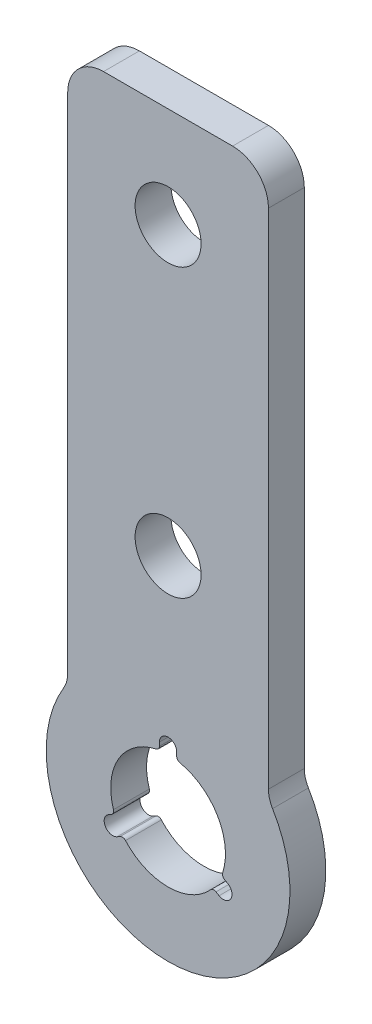
ISO-10303-21;
HEADER;
FILE_DESCRIPTION(('STEP AP214'),'2;1');
FILE_NAME('part.step','',(''),(''),'','','');
FILE_SCHEMA(('AUTOMOTIVE_DESIGN { 1 0 10303 214 1 1 1 1 }'));
ENDSEC;
DATA;
#1=APPLICATION_CONTEXT('core data for automotive mechanical design processes');
#2=APPLICATION_PROTOCOL_DEFINITION('international standard','automotive_design',2000,#1);
#3=PRODUCT_CONTEXT('',#1,'mechanical');
#4=PRODUCT('Part','Part','',(#3));
#5=PRODUCT_RELATED_PRODUCT_CATEGORY('part','',(#4));
#6=PRODUCT_DEFINITION_FORMATION('','',#4);
#7=PRODUCT_DEFINITION_CONTEXT('part definition',#1,'design');
#8=PRODUCT_DEFINITION('design','',#6,#7);
#9=PRODUCT_DEFINITION_SHAPE('','',#8);
#10=(LENGTH_UNIT() NAMED_UNIT(*) SI_UNIT(.MILLI.,.METRE.));
#11=(NAMED_UNIT(*) PLANE_ANGLE_UNIT() SI_UNIT($,.RADIAN.));
#12=(NAMED_UNIT(*) SI_UNIT($,.STERADIAN.) SOLID_ANGLE_UNIT());
#13=UNCERTAINTY_MEASURE_WITH_UNIT(LENGTH_MEASURE(1.E-05),#10,'distance_accuracy_value','');
#14=(GEOMETRIC_REPRESENTATION_CONTEXT(3) GLOBAL_UNCERTAINTY_ASSIGNED_CONTEXT((#13)) GLOBAL_UNIT_ASSIGNED_CONTEXT((#10,
#11,#12)) REPRESENTATION_CONTEXT('',''));
#15=CARTESIAN_POINT('',(0.,0.,0.));
#16=DIRECTION('',(0.,0.,1.));
#17=DIRECTION('',(1.,0.,0.));
#18=AXIS2_PLACEMENT_3D('',#15,#16,#17);
#19=CARTESIAN_POINT('',(0.183350414531519,-17.8927513227513,2.5));
#20=DIRECTION('',(0.,0.,1.));
#21=DIRECTION('',(1.,0.,0.));
#22=AXIS2_PLACEMENT_3D('',#19,#20,#21);
#23=PLANE('',#22);
#24=CARTESIAN_POINT('',(0.183350414531519,-1.89275132275134,2.5));
#25=DIRECTION('',(0.,0.,1.));
#26=DIRECTION('',(1.,0.,0.));
#27=AXIS2_PLACEMENT_3D('',#24,#25,#26);
#28=CIRCLE('',#27,2.3);
#29=CARTESIAN_POINT('',(2.48335041453152,-1.89275132275134,2.5));
#30=VERTEX_POINT('',#29);
#31=EDGE_CURVE('E267',#30,#30,#28,.T.);
#32=ORIENTED_EDGE('',*,*,#31,.F.);
#33=EDGE_LOOP('',(#32));
#34=FACE_BOUND('',#33,.T.);
#35=CARTESIAN_POINT('',(0.183350414531519,-17.8927513227513,2.5));
#36=DIRECTION('',(0.,0.,1.));
#37=DIRECTION('',(1.,0.,0.));
#38=AXIS2_PLACEMENT_3D('',#35,#36,#37);
#39=CIRCLE('',#38,8.49999999999999);
#40=CARTESIAN_POINT('',(-7.10236387118249,-13.5145819168303,2.5));
#41=VERTEX_POINT('',#40);
#42=CARTESIAN_POINT('',(7.46906470024554,-13.5145819168303,2.5));
#43=VERTEX_POINT('',#42);
#44=EDGE_CURVE('E347',#41,#43,#39,.T.);
#45=ORIENTED_EDGE('',*,*,#44,.T.);
#46=CARTESIAN_POINT('',(9.18335041453152,-12.4844244095553,2.5));
#47=DIRECTION('',(0.,0.,-1.));
#48=DIRECTION('',(1.,0.,0.));
#49=AXIS2_PLACEMENT_3D('',#46,#47,#48);
#50=CIRCLE('',#49,2.00000000000001);
#51=CARTESIAN_POINT('',(7.18335041453152,-12.4844244095553,2.5));
#52=VERTEX_POINT('',#51);
#53=EDGE_CURVE('E350',#43,#52,#50,.T.);
#54=ORIENTED_EDGE('',*,*,#53,.T.);
#55=DIRECTION('',(0.,1.,0.));
#56=VECTOR('',#55,1.);
#57=CARTESIAN_POINT('',(7.18335041453152,-12.4844244095553,2.5));
#58=LINE('',#57,#56);
#59=CARTESIAN_POINT('',(7.18335041453151,22.6072486772487,2.5));
#60=VERTEX_POINT('',#59);
#61=EDGE_CURVE('E353',#52,#60,#58,.T.);
#62=ORIENTED_EDGE('',*,*,#61,.T.);
#63=CARTESIAN_POINT('',(4.68335041453152,22.6072486772487,2.5));
#64=DIRECTION('',(0.,0.,1.));
#65=DIRECTION('',(1.,0.,0.));
#66=AXIS2_PLACEMENT_3D('',#63,#64,#65);
#67=CIRCLE('',#66,2.5);
#68=CARTESIAN_POINT('',(4.68335041453152,25.1072486772487,2.5));
#69=VERTEX_POINT('',#68);
#70=EDGE_CURVE('E355',#60,#69,#67,.T.);
#71=ORIENTED_EDGE('',*,*,#70,.T.);
#72=DIRECTION('',(-1.,0.,0.));
#73=VECTOR('',#72,1.);
#74=CARTESIAN_POINT('',(4.68335041453152,25.1072486772487,2.5));
#75=LINE('',#74,#73);
#76=CARTESIAN_POINT('',(-4.31664958546848,25.1072486772487,2.5));
#77=VERTEX_POINT('',#76);
#78=EDGE_CURVE('E357',#69,#77,#75,.T.);
#79=ORIENTED_EDGE('',*,*,#78,.T.);
#80=CARTESIAN_POINT('',(-4.31664958546848,22.6072486772487,2.5));
#81=DIRECTION('',(0.,0.,1.));
#82=DIRECTION('',(1.,0.,0.));
#83=AXIS2_PLACEMENT_3D('',#80,#81,#82);
#84=CIRCLE('',#83,2.5);
#85=CARTESIAN_POINT('',(-6.81664958546848,22.6072486772487,2.5));
#86=VERTEX_POINT('',#85);
#87=EDGE_CURVE('E359',#77,#86,#84,.T.);
#88=ORIENTED_EDGE('',*,*,#87,.T.);
#89=DIRECTION('',(0.,-1.,0.));
#90=VECTOR('',#89,1.);
#91=CARTESIAN_POINT('',(-6.81664958546848,22.6072486772487,2.5));
#92=LINE('',#91,#90);
#93=CARTESIAN_POINT('',(-6.81664958546847,-12.4844244095553,2.5));
#94=VERTEX_POINT('',#93);
#95=EDGE_CURVE('E361',#86,#94,#92,.T.);
#96=ORIENTED_EDGE('',*,*,#95,.T.);
#97=CARTESIAN_POINT('',(-8.81664958546848,-12.4844244095553,2.5));
#98=DIRECTION('',(0.,0.,-1.));
#99=DIRECTION('',(1.,0.,0.));
#100=AXIS2_PLACEMENT_3D('',#97,#98,#99);
#101=CIRCLE('',#100,2.00000000000002);
#102=EDGE_CURVE('E363',#94,#41,#101,.T.);
#103=ORIENTED_EDGE('',*,*,#102,.T.);
#104=EDGE_LOOP('',(#45,#54,#62,#71,#79,#88,#96,#103));
#105=FACE_BOUND('',#104,.T.);
#106=CARTESIAN_POINT('',(0.183350414531519,-17.8927513227513,2.5));
#107=DIRECTION('',(0.,0.,1.));
#108=DIRECTION('',(1.,0.,0.));
#109=AXIS2_PLACEMENT_3D('',#106,#107,#108);
#110=CIRCLE('',#109,4.00000000000035);
#111=CARTESIAN_POINT('',(3.98933022030555,-19.1234087560134,2.5));
#112=VERTEX_POINT('',#111);
#113=CARTESIAN_POINT('',(1.02055971685711,-13.9813474080294,2.5));
#114=VERTEX_POINT('',#113);
#115=EDGE_CURVE('E217',#112,#114,#110,.T.);
#116=ORIENTED_EDGE('',*,*,#115,.F.);
#117=CARTESIAN_POINT('',(4.2747787057381,-19.2157080635091,2.5));
#118=DIRECTION('',(0.,0.,-1.));
#119=DIRECTION('',(1.,0.,0.));
#120=AXIS2_PLACEMENT_3D('',#117,#118,#119);
#121=CIRCLE('',#120,0.299999999999881);
#122=CARTESIAN_POINT('',(4.124778705738,-19.4755156846442,2.5));
#123=VERTEX_POINT('',#122);
#124=EDGE_CURVE('E209',#123,#112,#121,.T.);
#125=ORIENTED_EDGE('',*,*,#124,.F.);
#126=DIRECTION('',(-0.866025403784713,0.499999999999524,0.));
#127=VECTOR('',#126,1.);
#128=CARTESIAN_POINT('',(4.3412718743323,-19.6005080738097,2.5));
#129=LINE('',#128,#127);
#130=CARTESIAN_POINT('',(4.34127187433219,-19.6005080738096,2.5));
#131=VERTEX_POINT('',#130);
#132=EDGE_CURVE('E264',#131,#123,#129,.T.);
#133=ORIENTED_EDGE('',*,*,#132,.F.);
#134=CARTESIAN_POINT('',(4.04127187433252,-20.1201233160803,2.5));
#135=DIRECTION('',(0.,0.,1.));
#136=DIRECTION('',(1.,0.,0.));
#137=AXIS2_PLACEMENT_3D('',#134,#135,#136);
#138=CIRCLE('',#137,0.599999999999643);
#139=CARTESIAN_POINT('',(3.74127187433252,-20.6397385583503,2.5));
#140=VERTEX_POINT('',#139);
#141=EDGE_CURVE('E262',#140,#131,#138,.T.);
#142=ORIENTED_EDGE('',*,*,#141,.F.);
#143=DIRECTION('',(0.866025403784714,-0.499999999999523,0.));
#144=VECTOR('',#143,1.);
#145=CARTESIAN_POINT('',(3.52477870573853,-20.514746169185,2.5));
#146=LINE('',#145,#144);
#147=CARTESIAN_POINT('',(3.52477870573853,-20.514746169185,2.5));
#148=VERTEX_POINT('',#147);
#149=EDGE_CURVE('E260',#148,#140,#146,.T.);
#150=ORIENTED_EDGE('',*,*,#149,.F.);
#151=CARTESIAN_POINT('',(3.37477870573817,-20.7745537903207,2.5));
#152=DIRECTION('',(0.,0.,-1.));
#153=DIRECTION('',(1.,0.,0.));
#154=AXIS2_PLACEMENT_3D('',#151,#152,#153);
#155=CIRCLE('',#154,0.300000000000423);
#156=CARTESIAN_POINT('',(3.15212091797926,-20.5734978042107,2.5));
#157=VERTEX_POINT('',#156);
#158=EDGE_CURVE('E258',#157,#148,#155,.T.);
#159=ORIENTED_EDGE('',*,*,#158,.F.);
#160=CARTESIAN_POINT('',(0.18335041453117,-17.8927513227517,2.5));
#161=DIRECTION('',(0.,0.,1.));
#162=DIRECTION('',(1.,0.,0.));
#163=AXIS2_PLACEMENT_3D('',#160,#161,#162);
#164=CIRCLE('',#163,3.99999999999983);
#165=CARTESIAN_POINT('',(-2.78542008891692,-20.5734978042107,2.5));
#166=VERTEX_POINT('',#165);
#167=EDGE_CURVE('E256',#166,#157,#164,.T.);
#168=ORIENTED_EDGE('',*,*,#167,.F.);
#169=CARTESIAN_POINT('',(-3.00807787667548,-20.7745537903203,2.5));
#170=DIRECTION('',(0.,0.,-1.));
#171=DIRECTION('',(1.,0.,0.));
#172=AXIS2_PLACEMENT_3D('',#169,#170,#171);
#173=CIRCLE('',#172,0.300000000000071);
#174=CARTESIAN_POINT('',(-3.1580778766756,-20.5147461691851,2.5));
#175=VERTEX_POINT('',#174);
#176=EDGE_CURVE('E254',#175,#166,#173,.T.);
#177=ORIENTED_EDGE('',*,*,#176,.F.);
#178=DIRECTION('',(0.866025403784441,0.499999999999996,0.));
#179=VECTOR('',#178,1.);
#180=CARTESIAN_POINT('',(-3.37457104526941,-20.6397385583505,2.5));
#181=LINE('',#180,#179);
#182=CARTESIAN_POINT('',(-3.37457104526941,-20.6397385583505,2.5));
#183=VERTEX_POINT('',#182);
#184=EDGE_CURVE('E252',#183,#175,#181,.T.);
#185=ORIENTED_EDGE('',*,*,#184,.F.);
#186=CARTESIAN_POINT('',(-3.67457104526973,-20.1201233160799,2.5));
#187=DIRECTION('',(0.,0.,1.));
#188=DIRECTION('',(1.,0.,0.));
#189=AXIS2_PLACEMENT_3D('',#186,#187,#188);
#190=CIRCLE('',#189,0.600000000000076);
#191=CARTESIAN_POINT('',(-3.97457104526962,-19.6005080738091,2.5));
#192=VERTEX_POINT('',#191);
#193=EDGE_CURVE('E250',#192,#183,#190,.T.);
#194=ORIENTED_EDGE('',*,*,#193,.F.);
#195=DIRECTION('',(-0.866025403784439,-0.5,0.));
#196=VECTOR('',#195,1.);
#197=CARTESIAN_POINT('',(-3.75807787667539,-19.4755156846435,2.5));
#198=LINE('',#197,#196);
#199=CARTESIAN_POINT('',(-3.75807787667535,-19.4755156846436,2.5));
#200=VERTEX_POINT('',#199);
#201=EDGE_CURVE('E248',#200,#192,#198,.T.);
#202=ORIENTED_EDGE('',*,*,#201,.F.);
#203=CARTESIAN_POINT('',(-3.90807787667548,-19.2157080635083,2.5));
#204=DIRECTION('',(0.,0.,-1.));
#205=DIRECTION('',(1.,0.,0.));
#206=AXIS2_PLACEMENT_3D('',#203,#204,#205);
#207=CIRCLE('',#206,0.299999999999973);
#208=CARTESIAN_POINT('',(-3.6226293912425,-19.1234087560133,2.5));
#209=VERTEX_POINT('',#208);
#210=EDGE_CURVE('E246',#209,#200,#207,.T.);
#211=ORIENTED_EDGE('',*,*,#210,.F.);
#212=CARTESIAN_POINT('',(0.183350414531519,-17.8927513227513,2.5));
#213=DIRECTION('',(0.,0.,1.));
#214=DIRECTION('',(1.,0.,0.));
#215=AXIS2_PLACEMENT_3D('',#212,#213,#214);
#216=CIRCLE('',#215,4.00000000000034);
#217=CARTESIAN_POINT('',(-0.653858887794062,-13.9813474080294,2.5));
#218=VERTEX_POINT('',#217);
#219=EDGE_CURVE('E244',#218,#209,#216,.T.);
#220=ORIENTED_EDGE('',*,*,#219,.F.);
#221=CARTESIAN_POINT('',(-0.716649585468479,-13.6879921144253,2.5));
#222=DIRECTION('',(0.,0.,-1.));
#223=DIRECTION('',(1.,0.,0.));
#224=AXIS2_PLACEMENT_3D('',#221,#222,#223);
#225=CIRCLE('',#224,0.299999999999966);
#226=CARTESIAN_POINT('',(-0.416649585468484,-13.6879921144253,2.5));
#227=VERTEX_POINT('',#226);
#228=EDGE_CURVE('E242',#227,#218,#225,.T.);
#229=ORIENTED_EDGE('',*,*,#228,.F.);
#230=DIRECTION('',(0.,-1.,0.));
#231=VECTOR('',#230,1.);
#232=CARTESIAN_POINT('',(-0.416649585468484,-13.4380073360943,2.5));
#233=LINE('',#232,#231);
#234=CARTESIAN_POINT('',(-0.416649585468484,-13.4380073360943,2.5));
#235=VERTEX_POINT('',#234);
#236=EDGE_CURVE('E240',#235,#227,#233,.T.);
#237=ORIENTED_EDGE('',*,*,#236,.F.);
#238=CARTESIAN_POINT('',(0.183350414531519,-13.4380073360943,2.5));
#239=DIRECTION('',(0.,0.,1.));
#240=DIRECTION('',(1.,0.,0.));
#241=AXIS2_PLACEMENT_3D('',#238,#239,#240);
#242=CIRCLE('',#241,0.600000000000003);
#243=CARTESIAN_POINT('',(0.783350414531522,-13.4380073360943,2.5));
#244=VERTEX_POINT('',#243);
#245=EDGE_CURVE('E238',#244,#235,#242,.T.);
#246=ORIENTED_EDGE('',*,*,#245,.F.);
#247=DIRECTION('',(-2.2205812530616E-13,1.,0.));
#248=VECTOR('',#247,1.);
#249=CARTESIAN_POINT('',(0.783350414531578,-13.6879921144253,2.5));
#250=LINE('',#249,#248);
#251=CARTESIAN_POINT('',(0.783350414531589,-13.6879921144253,2.5));
#252=VERTEX_POINT('',#251);
#253=EDGE_CURVE('E233',#252,#244,#250,.T.);
#254=ORIENTED_EDGE('',*,*,#253,.F.);
#255=CARTESIAN_POINT('',(1.08335041453152,-13.6879921144253,2.5));
#256=DIRECTION('',(0.,0.,-1.));
#257=DIRECTION('',(1.,0.,0.));
#258=AXIS2_PLACEMENT_3D('',#255,#256,#257);
#259=CIRCLE('',#258,0.299999999999928);
#260=EDGE_CURVE('E231',#114,#252,#259,.T.);
#261=ORIENTED_EDGE('',*,*,#260,.F.);
#262=EDGE_LOOP('',(#116,#125,#133,#142,#150,#159,#168,#177,#185,#194,#202,#211,#220,#229,#237,
#246,#254,#261));
#263=FACE_BOUND('',#262,.T.);
#264=CARTESIAN_POINT('',(0.183350414531519,18.1072486772487,2.5));
#265=DIRECTION('',(0.,0.,1.));
#266=DIRECTION('',(1.,0.,0.));
#267=AXIS2_PLACEMENT_3D('',#264,#265,#266);
#268=CIRCLE('',#267,2.3);
#269=CARTESIAN_POINT('',(2.48335041453152,18.1072486772487,2.5));
#270=VERTEX_POINT('',#269);
#271=EDGE_CURVE('E546',#270,#270,#268,.T.);
#272=ORIENTED_EDGE('',*,*,#271,.F.);
#273=EDGE_LOOP('',(#272));
#274=FACE_BOUND('',#273,.T.);
#275=ADVANCED_FACE('F36',(#34,#105,#263,#274),#23,.T.);
#276=CARTESIAN_POINT('',(0.183350414531519,-17.8927513227513,0.));
#277=DIRECTION('',(0.,0.,1.));
#278=DIRECTION('',(1.,0.,0.));
#279=AXIS2_PLACEMENT_3D('',#276,#277,#278);
#280=PLANE('',#279);
#281=CARTESIAN_POINT('',(0.183350414531519,-17.8927513227513,0.));
#282=DIRECTION('',(0.,0.,1.));
#283=DIRECTION('',(1.,0.,0.));
#284=AXIS2_PLACEMENT_3D('',#281,#282,#283);
#285=CIRCLE('',#284,8.49999999999999);
#286=CARTESIAN_POINT('',(-7.10236387118249,-13.5145819168303,0.));
#287=VERTEX_POINT('',#286);
#288=CARTESIAN_POINT('',(7.46906470024554,-13.5145819168303,0.));
#289=VERTEX_POINT('',#288);
#290=EDGE_CURVE('E225',#287,#289,#285,.T.);
#291=ORIENTED_EDGE('',*,*,#290,.F.);
#292=CARTESIAN_POINT('',(-8.81664958546848,-12.4844244095553,0.));
#293=DIRECTION('',(0.,0.,-1.));
#294=DIRECTION('',(1.,0.,0.));
#295=AXIS2_PLACEMENT_3D('',#292,#293,#294);
#296=CIRCLE('',#295,2.00000000000002);
#297=CARTESIAN_POINT('',(-6.81664958546847,-12.4844244095553,0.));
#298=VERTEX_POINT('',#297);
#299=EDGE_CURVE('E351',#298,#287,#296,.T.);
#300=ORIENTED_EDGE('',*,*,#299,.F.);
#301=DIRECTION('',(0.,-1.,0.));
#302=VECTOR('',#301,1.);
#303=CARTESIAN_POINT('',(-6.81664958546848,22.6072486772487,0.));
#304=LINE('',#303,#302);
#305=CARTESIAN_POINT('',(-6.81664958546848,22.6072486772487,0.));
#306=VERTEX_POINT('',#305);
#307=EDGE_CURVE('E378',#306,#298,#304,.T.);
#308=ORIENTED_EDGE('',*,*,#307,.F.);
#309=CARTESIAN_POINT('',(-4.31664958546848,22.6072486772487,0.));
#310=DIRECTION('',(0.,0.,1.));
#311=DIRECTION('',(1.,0.,0.));
#312=AXIS2_PLACEMENT_3D('',#309,#310,#311);
#313=CIRCLE('',#312,2.5);
#314=CARTESIAN_POINT('',(-4.31664958546848,25.1072486772487,0.));
#315=VERTEX_POINT('',#314);
#316=EDGE_CURVE('E376',#315,#306,#313,.T.);
#317=ORIENTED_EDGE('',*,*,#316,.F.);
#318=DIRECTION('',(-1.,0.,0.));
#319=VECTOR('',#318,1.);
#320=CARTESIAN_POINT('',(4.68335041453152,25.1072486772487,0.));
#321=LINE('',#320,#319);
#322=CARTESIAN_POINT('',(4.68335041453152,25.1072486772487,0.));
#323=VERTEX_POINT('',#322);
#324=EDGE_CURVE('E374',#323,#315,#321,.T.);
#325=ORIENTED_EDGE('',*,*,#324,.F.);
#326=CARTESIAN_POINT('',(4.68335041453152,22.6072486772487,0.));
#327=DIRECTION('',(0.,0.,1.));
#328=DIRECTION('',(1.,0.,0.));
#329=AXIS2_PLACEMENT_3D('',#326,#327,#328);
#330=CIRCLE('',#329,2.5);
#331=CARTESIAN_POINT('',(7.18335041453151,22.6072486772487,0.));
#332=VERTEX_POINT('',#331);
#333=EDGE_CURVE('E372',#332,#323,#330,.T.);
#334=ORIENTED_EDGE('',*,*,#333,.F.);
#335=DIRECTION('',(0.,1.,0.));
#336=VECTOR('',#335,1.);
#337=CARTESIAN_POINT('',(7.18335041453152,-12.4844244095553,0.));
#338=LINE('',#337,#336);
#339=CARTESIAN_POINT('',(7.18335041453152,-12.4844244095553,0.));
#340=VERTEX_POINT('',#339);
#341=EDGE_CURVE('E370',#340,#332,#338,.T.);
#342=ORIENTED_EDGE('',*,*,#341,.F.);
#343=CARTESIAN_POINT('',(9.18335041453152,-12.4844244095553,0.));
#344=DIRECTION('',(0.,0.,-1.));
#345=DIRECTION('',(1.,0.,0.));
#346=AXIS2_PLACEMENT_3D('',#343,#344,#345);
#347=CIRCLE('',#346,2.00000000000001);
#348=EDGE_CURVE('E368',#289,#340,#347,.T.);
#349=ORIENTED_EDGE('',*,*,#348,.F.);
#350=EDGE_LOOP('',(#291,#300,#308,#317,#325,#334,#342,#349));
#351=FACE_BOUND('',#350,.T.);
#352=CARTESIAN_POINT('',(4.2747787057381,-19.2157080635091,0.));
#353=DIRECTION('',(0.,0.,-1.));
#354=DIRECTION('',(1.,0.,0.));
#355=AXIS2_PLACEMENT_3D('',#352,#353,#354);
#356=CIRCLE('',#355,0.299999999999881);
#357=CARTESIAN_POINT('',(4.124778705738,-19.4755156846442,0.));
#358=VERTEX_POINT('',#357);
#359=CARTESIAN_POINT('',(3.98933022030555,-19.1234087560134,0.));
#360=VERTEX_POINT('',#359);
#361=EDGE_CURVE('E59',#358,#360,#356,.T.);
#362=ORIENTED_EDGE('',*,*,#361,.T.);
#363=CARTESIAN_POINT('',(0.183350414531519,-17.8927513227513,0.));
#364=DIRECTION('',(0.,0.,1.));
#365=DIRECTION('',(1.,0.,0.));
#366=AXIS2_PLACEMENT_3D('',#363,#364,#365);
#367=CIRCLE('',#366,4.00000000000035);
#368=CARTESIAN_POINT('',(1.02055971685711,-13.9813474080294,0.));
#369=VERTEX_POINT('',#368);
#370=EDGE_CURVE('E224',#360,#369,#367,.T.);
#371=ORIENTED_EDGE('',*,*,#370,.T.);
#372=CARTESIAN_POINT('',(1.08335041453152,-13.6879921144253,0.));
#373=DIRECTION('',(0.,0.,-1.));
#374=DIRECTION('',(1.,0.,0.));
#375=AXIS2_PLACEMENT_3D('',#372,#373,#374);
#376=CIRCLE('',#375,0.299999999999928);
#377=CARTESIAN_POINT('',(0.783350414531589,-13.6879921144253,0.));
#378=VERTEX_POINT('',#377);
#379=EDGE_CURVE('E269',#369,#378,#376,.T.);
#380=ORIENTED_EDGE('',*,*,#379,.T.);
#381=DIRECTION('',(-2.2205812530616E-13,1.,0.));
#382=VECTOR('',#381,1.);
#383=CARTESIAN_POINT('',(0.783350414531578,-13.6879921144253,0.));
#384=LINE('',#383,#382);
#385=CARTESIAN_POINT('',(0.783350414531522,-13.4380073360943,0.));
#386=VERTEX_POINT('',#385);
#387=EDGE_CURVE('E272',#378,#386,#384,.T.);
#388=ORIENTED_EDGE('',*,*,#387,.T.);
#389=CARTESIAN_POINT('',(0.183350414531519,-13.4380073360943,0.));
#390=DIRECTION('',(0.,0.,1.));
#391=DIRECTION('',(1.,0.,0.));
#392=AXIS2_PLACEMENT_3D('',#389,#390,#391);
#393=CIRCLE('',#392,0.600000000000003);
#394=CARTESIAN_POINT('',(-0.416649585468484,-13.4380073360943,0.));
#395=VERTEX_POINT('',#394);
#396=EDGE_CURVE('E275',#386,#395,#393,.T.);
#397=ORIENTED_EDGE('',*,*,#396,.T.);
#398=DIRECTION('',(0.,-1.,0.));
#399=VECTOR('',#398,1.);
#400=CARTESIAN_POINT('',(-0.416649585468484,-13.4380073360943,0.));
#401=LINE('',#400,#399);
#402=CARTESIAN_POINT('',(-0.416649585468484,-13.6879921144253,0.));
#403=VERTEX_POINT('',#402);
#404=EDGE_CURVE('E278',#395,#403,#401,.T.);
#405=ORIENTED_EDGE('',*,*,#404,.T.);
#406=CARTESIAN_POINT('',(-0.716649585468479,-13.6879921144253,0.));
#407=DIRECTION('',(0.,0.,-1.));
#408=DIRECTION('',(1.,0.,0.));
#409=AXIS2_PLACEMENT_3D('',#406,#407,#408);
#410=CIRCLE('',#409,0.299999999999966);
#411=CARTESIAN_POINT('',(-0.653858887794062,-13.9813474080294,0.));
#412=VERTEX_POINT('',#411);
#413=EDGE_CURVE('E281',#403,#412,#410,.T.);
#414=ORIENTED_EDGE('',*,*,#413,.T.);
#415=CARTESIAN_POINT('',(0.183350414531519,-17.8927513227513,0.));
#416=DIRECTION('',(0.,0.,1.));
#417=DIRECTION('',(1.,0.,0.));
#418=AXIS2_PLACEMENT_3D('',#415,#416,#417);
#419=CIRCLE('',#418,4.00000000000034);
#420=CARTESIAN_POINT('',(-3.6226293912425,-19.1234087560133,0.));
#421=VERTEX_POINT('',#420);
#422=EDGE_CURVE('E284',#412,#421,#419,.T.);
#423=ORIENTED_EDGE('',*,*,#422,.T.);
#424=CARTESIAN_POINT('',(-3.90807787667548,-19.2157080635083,0.));
#425=DIRECTION('',(0.,0.,-1.));
#426=DIRECTION('',(1.,0.,0.));
#427=AXIS2_PLACEMENT_3D('',#424,#425,#426);
#428=CIRCLE('',#427,0.299999999999973);
#429=CARTESIAN_POINT('',(-3.75807787667535,-19.4755156846436,0.));
#430=VERTEX_POINT('',#429);
#431=EDGE_CURVE('E287',#421,#430,#428,.T.);
#432=ORIENTED_EDGE('',*,*,#431,.T.);
#433=DIRECTION('',(-0.866025403784439,-0.5,0.));
#434=VECTOR('',#433,1.);
#435=CARTESIAN_POINT('',(-3.75807787667539,-19.4755156846435,0.));
#436=LINE('',#435,#434);
#437=CARTESIAN_POINT('',(-3.97457104526962,-19.6005080738091,0.));
#438=VERTEX_POINT('',#437);
#439=EDGE_CURVE('E290',#430,#438,#436,.T.);
#440=ORIENTED_EDGE('',*,*,#439,.T.);
#441=CARTESIAN_POINT('',(-3.67457104526973,-20.1201233160799,0.));
#442=DIRECTION('',(0.,0.,1.));
#443=DIRECTION('',(1.,0.,0.));
#444=AXIS2_PLACEMENT_3D('',#441,#442,#443);
#445=CIRCLE('',#444,0.600000000000076);
#446=CARTESIAN_POINT('',(-3.37457104526941,-20.6397385583505,0.));
#447=VERTEX_POINT('',#446);
#448=EDGE_CURVE('E293',#438,#447,#445,.T.);
#449=ORIENTED_EDGE('',*,*,#448,.T.);
#450=DIRECTION('',(0.866025403784441,0.499999999999996,0.));
#451=VECTOR('',#450,1.);
#452=CARTESIAN_POINT('',(-3.37457104526941,-20.6397385583505,0.));
#453=LINE('',#452,#451);
#454=CARTESIAN_POINT('',(-3.1580778766756,-20.5147461691851,0.));
#455=VERTEX_POINT('',#454);
#456=EDGE_CURVE('E296',#447,#455,#453,.T.);
#457=ORIENTED_EDGE('',*,*,#456,.T.);
#458=CARTESIAN_POINT('',(-3.00807787667548,-20.7745537903203,0.));
#459=DIRECTION('',(0.,0.,-1.));
#460=DIRECTION('',(1.,0.,0.));
#461=AXIS2_PLACEMENT_3D('',#458,#459,#460);
#462=CIRCLE('',#461,0.300000000000071);
#463=CARTESIAN_POINT('',(-2.78542008891692,-20.5734978042107,0.));
#464=VERTEX_POINT('',#463);
#465=EDGE_CURVE('E299',#455,#464,#462,.T.);
#466=ORIENTED_EDGE('',*,*,#465,.T.);
#467=CARTESIAN_POINT('',(0.18335041453117,-17.8927513227517,0.));
#468=DIRECTION('',(0.,0.,1.));
#469=DIRECTION('',(1.,0.,0.));
#470=AXIS2_PLACEMENT_3D('',#467,#468,#469);
#471=CIRCLE('',#470,3.99999999999983);
#472=CARTESIAN_POINT('',(3.15212091797926,-20.5734978042107,0.));
#473=VERTEX_POINT('',#472);
#474=EDGE_CURVE('E302',#464,#473,#471,.T.);
#475=ORIENTED_EDGE('',*,*,#474,.T.);
#476=CARTESIAN_POINT('',(3.37477870573817,-20.7745537903207,0.));
#477=DIRECTION('',(0.,0.,-1.));
#478=DIRECTION('',(1.,0.,0.));
#479=AXIS2_PLACEMENT_3D('',#476,#477,#478);
#480=CIRCLE('',#479,0.300000000000423);
#481=CARTESIAN_POINT('',(3.52477870573853,-20.514746169185,0.));
#482=VERTEX_POINT('',#481);
#483=EDGE_CURVE('E305',#473,#482,#480,.T.);
#484=ORIENTED_EDGE('',*,*,#483,.T.);
#485=DIRECTION('',(0.866025403784714,-0.499999999999523,0.));
#486=VECTOR('',#485,1.);
#487=CARTESIAN_POINT('',(3.52477870573853,-20.514746169185,0.));
#488=LINE('',#487,#486);
#489=CARTESIAN_POINT('',(3.74127187433252,-20.6397385583503,0.));
#490=VERTEX_POINT('',#489);
#491=EDGE_CURVE('E308',#482,#490,#488,.T.);
#492=ORIENTED_EDGE('',*,*,#491,.T.);
#493=CARTESIAN_POINT('',(4.04127187433252,-20.1201233160803,0.));
#494=DIRECTION('',(0.,0.,1.));
#495=DIRECTION('',(1.,0.,0.));
#496=AXIS2_PLACEMENT_3D('',#493,#494,#495);
#497=CIRCLE('',#496,0.599999999999643);
#498=CARTESIAN_POINT('',(4.34127187433219,-19.6005080738099,0.));
#499=VERTEX_POINT('',#498);
#500=EDGE_CURVE('E311',#490,#499,#497,.T.);
#501=ORIENTED_EDGE('',*,*,#500,.T.);
#502=DIRECTION('',(-0.866025403784713,0.499999999999524,0.));
#503=VECTOR('',#502,1.);
#504=CARTESIAN_POINT('',(4.3412718743323,-19.6005080738097,0.));
#505=LINE('',#504,#503);
#506=EDGE_CURVE('E218',#499,#358,#505,.T.);
#507=ORIENTED_EDGE('',*,*,#506,.T.);
#508=EDGE_LOOP('',(#362,#371,#380,#388,#397,#405,#414,#423,#432,#440,#449,#457,#466,#475,#484,
#492,#501,#507));
#509=FACE_BOUND('',#508,.T.);
#510=CARTESIAN_POINT('',(0.183350414531519,-1.89275132275134,0.));
#511=DIRECTION('',(0.,0.,1.));
#512=DIRECTION('',(1.,0.,0.));
#513=AXIS2_PLACEMENT_3D('',#510,#511,#512);
#514=CIRCLE('',#513,2.3);
#515=CARTESIAN_POINT('',(2.48335041453152,-1.89275132275134,0.));
#516=VERTEX_POINT('',#515);
#517=EDGE_CURVE('E547',#516,#516,#514,.T.);
#518=ORIENTED_EDGE('',*,*,#517,.T.);
#519=EDGE_LOOP('',(#518));
#520=FACE_BOUND('',#519,.T.);
#521=CARTESIAN_POINT('',(0.183350414531519,18.1072486772487,0.));
#522=DIRECTION('',(0.,0.,1.));
#523=DIRECTION('',(1.,0.,0.));
#524=AXIS2_PLACEMENT_3D('',#521,#522,#523);
#525=CIRCLE('',#524,2.3);
#526=CARTESIAN_POINT('',(2.48335041453152,18.1072486772487,0.));
#527=VERTEX_POINT('',#526);
#528=EDGE_CURVE('E543',#527,#527,#525,.T.);
#529=ORIENTED_EDGE('',*,*,#528,.T.);
#530=EDGE_LOOP('',(#529));
#531=FACE_BOUND('',#530,.T.);
#532=ADVANCED_FACE('F408',(#351,#509,#520,#531),#280,.F.);
#533=CARTESIAN_POINT('',(0.183350414531519,-17.8927513227513,2.5));
#534=DIRECTION('',(0.,0.,-1.));
#535=DIRECTION('',(-1.,0.,0.));
#536=AXIS2_PLACEMENT_3D('',#533,#534,#535);
#537=CYLINDRICAL_SURFACE('',#536,8.49999999999999);
#538=ORIENTED_EDGE('',*,*,#290,.T.);
#539=DIRECTION('',(0.,0.,-1.));
#540=VECTOR('',#539,1.);
#541=CARTESIAN_POINT('',(7.46906470024554,-13.5145819168303,2.5));
#542=LINE('',#541,#540);
#543=EDGE_CURVE('E11',#43,#289,#542,.T.);
#544=ORIENTED_EDGE('',*,*,#543,.F.);
#545=ORIENTED_EDGE('',*,*,#44,.F.);
#546=DIRECTION('',(0.,0.,-1.));
#547=VECTOR('',#546,1.);
#548=CARTESIAN_POINT('',(-7.10236387118249,-13.5145819168303,2.5));
#549=LINE('',#548,#547);
#550=EDGE_CURVE('E365',#41,#287,#549,.T.);
#551=ORIENTED_EDGE('',*,*,#550,.T.);
#552=EDGE_LOOP('',(#538,#544,#545,#551));
#553=FACE_BOUND('',#552,.T.);
#554=ADVANCED_FACE('F38',(#553),#537,.T.);
#555=CARTESIAN_POINT('',(9.18335041453152,-12.4844244095553,2.5));
#556=DIRECTION('',(0.,0.,-1.));
#557=DIRECTION('',(-1.,0.,0.));
#558=AXIS2_PLACEMENT_3D('',#555,#556,#557);
#559=CYLINDRICAL_SURFACE('',#558,2.00000000000001);
#560=ORIENTED_EDGE('',*,*,#348,.T.);
#561=DIRECTION('',(0.,0.,-1.));
#562=VECTOR('',#561,1.);
#563=CARTESIAN_POINT('',(7.18335041453152,-12.4844244095553,2.5));
#564=LINE('',#563,#562);
#565=EDGE_CURVE('E44',#52,#340,#564,.T.);
#566=ORIENTED_EDGE('',*,*,#565,.F.);
#567=ORIENTED_EDGE('',*,*,#53,.F.);
#568=ORIENTED_EDGE('',*,*,#543,.T.);
#569=EDGE_LOOP('',(#560,#566,#567,#568));
#570=FACE_BOUND('',#569,.T.);
#571=ADVANCED_FACE('F425',(#570),#559,.F.);
#572=CARTESIAN_POINT('',(7.18335041453152,-12.4844244095553,2.5));
#573=DIRECTION('',(-1.,0.,0.));
#574=DIRECTION('',(0.,-1.,0.));
#575=AXIS2_PLACEMENT_3D('',#572,#573,#574);
#576=PLANE('',#575);
#577=ORIENTED_EDGE('',*,*,#341,.T.);
#578=DIRECTION('',(0.,0.,-1.));
#579=VECTOR('',#578,1.);
#580=CARTESIAN_POINT('',(7.18335041453151,22.6072486772487,2.5));
#581=LINE('',#580,#579);
#582=EDGE_CURVE('E395',#60,#332,#581,.T.);
#583=ORIENTED_EDGE('',*,*,#582,.F.);
#584=ORIENTED_EDGE('',*,*,#61,.F.);
#585=ORIENTED_EDGE('',*,*,#565,.T.);
#586=EDGE_LOOP('',(#577,#583,#584,#585));
#587=FACE_BOUND('',#586,.T.);
#588=ADVANCED_FACE('F402',(#587),#576,.F.);
#589=CARTESIAN_POINT('',(4.68335041453152,22.6072486772487,2.5));
#590=DIRECTION('',(0.,0.,-1.));
#591=DIRECTION('',(-1.,0.,0.));
#592=AXIS2_PLACEMENT_3D('',#589,#590,#591);
#593=CYLINDRICAL_SURFACE('',#592,2.5);
#594=ORIENTED_EDGE('',*,*,#333,.T.);
#595=DIRECTION('',(0.,0.,-1.));
#596=VECTOR('',#595,1.);
#597=CARTESIAN_POINT('',(4.68335041453152,25.1072486772487,2.5));
#598=LINE('',#597,#596);
#599=EDGE_CURVE('E392',#69,#323,#598,.T.);
#600=ORIENTED_EDGE('',*,*,#599,.F.);
#601=ORIENTED_EDGE('',*,*,#70,.F.);
#602=ORIENTED_EDGE('',*,*,#582,.T.);
#603=EDGE_LOOP('',(#594,#600,#601,#602));
#604=FACE_BOUND('',#603,.T.);
#605=ADVANCED_FACE('F414',(#604),#593,.T.);
#606=CARTESIAN_POINT('',(4.68335041453152,25.1072486772487,2.5));
#607=DIRECTION('',(0.,-1.,0.));
#608=DIRECTION('',(0.,0.,-1.));
#609=AXIS2_PLACEMENT_3D('',#606,#607,#608);
#610=PLANE('',#609);
#611=ORIENTED_EDGE('',*,*,#324,.T.);
#612=DIRECTION('',(0.,0.,-1.));
#613=VECTOR('',#612,1.);
#614=CARTESIAN_POINT('',(-4.31664958546848,25.1072486772487,2.5));
#615=LINE('',#614,#613);
#616=EDGE_CURVE('E389',#77,#315,#615,.T.);
#617=ORIENTED_EDGE('',*,*,#616,.F.);
#618=ORIENTED_EDGE('',*,*,#78,.F.);
#619=ORIENTED_EDGE('',*,*,#599,.T.);
#620=EDGE_LOOP('',(#611,#617,#618,#619));
#621=FACE_BOUND('',#620,.T.);
#622=ADVANCED_FACE('F418',(#621),#610,.F.);
#623=CARTESIAN_POINT('',(-4.31664958546848,22.6072486772487,2.5));
#624=DIRECTION('',(0.,0.,-1.));
#625=DIRECTION('',(-1.,0.,0.));
#626=AXIS2_PLACEMENT_3D('',#623,#624,#625);
#627=CYLINDRICAL_SURFACE('',#626,2.5);
#628=ORIENTED_EDGE('',*,*,#316,.T.);
#629=DIRECTION('',(0.,0.,-1.));
#630=VECTOR('',#629,1.);
#631=CARTESIAN_POINT('',(-6.81664958546848,22.6072486772487,2.5));
#632=LINE('',#631,#630);
#633=EDGE_CURVE('E386',#86,#306,#632,.T.);
#634=ORIENTED_EDGE('',*,*,#633,.F.);
#635=ORIENTED_EDGE('',*,*,#87,.F.);
#636=ORIENTED_EDGE('',*,*,#616,.T.);
#637=EDGE_LOOP('',(#628,#634,#635,#636));
#638=FACE_BOUND('',#637,.T.);
#639=ADVANCED_FACE('F438',(#638),#627,.T.);
#640=CARTESIAN_POINT('',(-6.81664958546848,22.6072486772487,2.5));
#641=DIRECTION('',(1.,0.,0.));
#642=DIRECTION('',(0.,1.,0.));
#643=AXIS2_PLACEMENT_3D('',#640,#641,#642);
#644=PLANE('',#643);
#645=ORIENTED_EDGE('',*,*,#307,.T.);
#646=DIRECTION('',(0.,0.,-1.));
#647=VECTOR('',#646,1.);
#648=CARTESIAN_POINT('',(-6.81664958546847,-12.4844244095553,2.5));
#649=LINE('',#648,#647);
#650=EDGE_CURVE('E383',#94,#298,#649,.T.);
#651=ORIENTED_EDGE('',*,*,#650,.F.);
#652=ORIENTED_EDGE('',*,*,#95,.F.);
#653=ORIENTED_EDGE('',*,*,#633,.T.);
#654=EDGE_LOOP('',(#645,#651,#652,#653));
#655=FACE_BOUND('',#654,.T.);
#656=ADVANCED_FACE('F436',(#655),#644,.F.);
#657=CARTESIAN_POINT('',(-8.81664958546848,-12.4844244095553,2.5));
#658=DIRECTION('',(0.,0.,-1.));
#659=DIRECTION('',(-1.,0.,0.));
#660=AXIS2_PLACEMENT_3D('',#657,#658,#659);
#661=CYLINDRICAL_SURFACE('',#660,2.00000000000002);
#662=ORIENTED_EDGE('',*,*,#299,.T.);
#663=ORIENTED_EDGE('',*,*,#550,.F.);
#664=ORIENTED_EDGE('',*,*,#102,.F.);
#665=ORIENTED_EDGE('',*,*,#650,.T.);
#666=EDGE_LOOP('',(#662,#663,#664,#665));
#667=FACE_BOUND('',#666,.T.);
#668=ADVANCED_FACE('F431',(#667),#661,.F.);
#669=CARTESIAN_POINT('',(4.2747787057381,-19.2157080635091,2.5));
#670=DIRECTION('',(0.,0.,-1.));
#671=DIRECTION('',(-1.,0.,0.));
#672=AXIS2_PLACEMENT_3D('',#669,#670,#671);
#673=CYLINDRICAL_SURFACE('',#672,0.299999999999881);
#674=ORIENTED_EDGE('',*,*,#361,.F.);
#675=DIRECTION('',(0.,0.,-1.));
#676=VECTOR('',#675,1.);
#677=CARTESIAN_POINT('',(4.124778705738,-19.4755156846442,2.5));
#678=LINE('',#677,#676);
#679=EDGE_CURVE('E213',#123,#358,#678,.T.);
#680=ORIENTED_EDGE('',*,*,#679,.F.);
#681=ORIENTED_EDGE('',*,*,#124,.T.);
#682=DIRECTION('',(0.,0.,-1.));
#683=VECTOR('',#682,1.);
#684=CARTESIAN_POINT('',(3.98933022030555,-19.1234087560134,2.5));
#685=LINE('',#684,#683);
#686=EDGE_CURVE('E212',#112,#360,#685,.T.);
#687=ORIENTED_EDGE('',*,*,#686,.T.);
#688=EDGE_LOOP('',(#674,#680,#681,#687));
#689=FACE_BOUND('',#688,.T.);
#690=ADVANCED_FACE('F211',(#689),#673,.T.);
#691=CARTESIAN_POINT('',(0.183350414531519,-17.8927513227513,2.5));
#692=DIRECTION('',(0.,0.,-1.));
#693=DIRECTION('',(-1.,0.,0.));
#694=AXIS2_PLACEMENT_3D('',#691,#692,#693);
#695=CYLINDRICAL_SURFACE('',#694,4.00000000000035);
#696=ORIENTED_EDGE('',*,*,#370,.F.);
#697=ORIENTED_EDGE('',*,*,#686,.F.);
#698=ORIENTED_EDGE('',*,*,#115,.T.);
#699=DIRECTION('',(0.,0.,-1.));
#700=VECTOR('',#699,1.);
#701=CARTESIAN_POINT('',(1.02055971685711,-13.9813474080294,2.5));
#702=LINE('',#701,#700);
#703=EDGE_CURVE('E226',#114,#369,#702,.T.);
#704=ORIENTED_EDGE('',*,*,#703,.T.);
#705=EDGE_LOOP('',(#696,#697,#698,#704));
#706=FACE_BOUND('',#705,.T.);
#707=ADVANCED_FACE('F221',(#706),#695,.F.);
#708=CARTESIAN_POINT('',(1.08335041453152,-13.6879921144253,2.5));
#709=DIRECTION('',(0.,0.,-1.));
#710=DIRECTION('',(-1.,0.,0.));
#711=AXIS2_PLACEMENT_3D('',#708,#709,#710);
#712=CYLINDRICAL_SURFACE('',#711,0.299999999999928);
#713=ORIENTED_EDGE('',*,*,#379,.F.);
#714=ORIENTED_EDGE('',*,*,#703,.F.);
#715=ORIENTED_EDGE('',*,*,#260,.T.);
#716=DIRECTION('',(0.,0.,-1.));
#717=VECTOR('',#716,1.);
#718=CARTESIAN_POINT('',(0.783350414531589,-13.6879921144253,2.5));
#719=LINE('',#718,#717);
#720=EDGE_CURVE('E344',#252,#378,#719,.T.);
#721=ORIENTED_EDGE('',*,*,#720,.T.);
#722=EDGE_LOOP('',(#713,#714,#715,#721));
#723=FACE_BOUND('',#722,.T.);
#724=ADVANCED_FACE('F465',(#723),#712,.T.);
#725=CARTESIAN_POINT('',(0.783350414531578,-13.6879921144253,2.5));
#726=DIRECTION('',(-1.,-2.2205812530616E-13,0.));
#727=DIRECTION('',(2.2205812530616E-13,-1.,0.));
#728=AXIS2_PLACEMENT_3D('',#725,#726,#727);
#729=PLANE('',#728);
#730=ORIENTED_EDGE('',*,*,#387,.F.);
#731=ORIENTED_EDGE('',*,*,#720,.F.);
#732=ORIENTED_EDGE('',*,*,#253,.T.);
#733=DIRECTION('',(0.,0.,-1.));
#734=VECTOR('',#733,1.);
#735=CARTESIAN_POINT('',(0.783350414531522,-13.4380073360943,2.5));
#736=LINE('',#735,#734);
#737=EDGE_CURVE('E342',#244,#386,#736,.T.);
#738=ORIENTED_EDGE('',*,*,#737,.T.);
#739=EDGE_LOOP('',(#730,#731,#732,#738));
#740=FACE_BOUND('',#739,.T.);
#741=ADVANCED_FACE('F469',(#740),#729,.T.);
#742=CARTESIAN_POINT('',(0.183350414531519,-13.4380073360943,2.5));
#743=DIRECTION('',(0.,0.,-1.));
#744=DIRECTION('',(-1.,0.,0.));
#745=AXIS2_PLACEMENT_3D('',#742,#743,#744);
#746=CYLINDRICAL_SURFACE('',#745,0.600000000000003);
#747=ORIENTED_EDGE('',*,*,#396,.F.);
#748=ORIENTED_EDGE('',*,*,#737,.F.);
#749=ORIENTED_EDGE('',*,*,#245,.T.);
#750=DIRECTION('',(0.,0.,-1.));
#751=VECTOR('',#750,1.);
#752=CARTESIAN_POINT('',(-0.416649585468484,-13.4380073360943,2.5));
#753=LINE('',#752,#751);
#754=EDGE_CURVE('E340',#235,#395,#753,.T.);
#755=ORIENTED_EDGE('',*,*,#754,.T.);
#756=EDGE_LOOP('',(#747,#748,#749,#755));
#757=FACE_BOUND('',#756,.T.);
#758=ADVANCED_FACE('F475',(#757),#746,.F.);
#759=CARTESIAN_POINT('',(-0.416649585468484,-13.4380073360943,2.5));
#760=DIRECTION('',(1.,0.,0.));
#761=DIRECTION('',(0.,0.,-1.));
#762=AXIS2_PLACEMENT_3D('',#759,#760,#761);
#763=PLANE('',#762);
#764=ORIENTED_EDGE('',*,*,#404,.F.);
#765=ORIENTED_EDGE('',*,*,#754,.F.);
#766=ORIENTED_EDGE('',*,*,#236,.T.);
#767=DIRECTION('',(0.,0.,-1.));
#768=VECTOR('',#767,1.);
#769=CARTESIAN_POINT('',(-0.416649585468484,-13.6879921144253,2.5));
#770=LINE('',#769,#768);
#771=EDGE_CURVE('E338',#227,#403,#770,.T.);
#772=ORIENTED_EDGE('',*,*,#771,.T.);
#773=EDGE_LOOP('',(#764,#765,#766,#772));
#774=FACE_BOUND('',#773,.T.);
#775=ADVANCED_FACE('F479',(#774),#763,.T.);
#776=CARTESIAN_POINT('',(-0.716649585468479,-13.6879921144253,2.5));
#777=DIRECTION('',(0.,0.,-1.));
#778=DIRECTION('',(-1.,0.,0.));
#779=AXIS2_PLACEMENT_3D('',#776,#777,#778);
#780=CYLINDRICAL_SURFACE('',#779,0.299999999999966);
#781=ORIENTED_EDGE('',*,*,#413,.F.);
#782=ORIENTED_EDGE('',*,*,#771,.F.);
#783=ORIENTED_EDGE('',*,*,#228,.T.);
#784=DIRECTION('',(0.,0.,-1.));
#785=VECTOR('',#784,1.);
#786=CARTESIAN_POINT('',(-0.653858887794062,-13.9813474080294,2.5));
#787=LINE('',#786,#785);
#788=EDGE_CURVE('E336',#218,#412,#787,.T.);
#789=ORIENTED_EDGE('',*,*,#788,.T.);
#790=EDGE_LOOP('',(#781,#782,#783,#789));
#791=FACE_BOUND('',#790,.T.);
#792=ADVANCED_FACE('F483',(#791),#780,.T.);
#793=CARTESIAN_POINT('',(0.183350414531519,-17.8927513227513,2.5));
#794=DIRECTION('',(0.,0.,-1.));
#795=DIRECTION('',(-1.,0.,0.));
#796=AXIS2_PLACEMENT_3D('',#793,#794,#795);
#797=CYLINDRICAL_SURFACE('',#796,4.00000000000034);
#798=ORIENTED_EDGE('',*,*,#422,.F.);
#799=ORIENTED_EDGE('',*,*,#788,.F.);
#800=ORIENTED_EDGE('',*,*,#219,.T.);
#801=DIRECTION('',(0.,0.,-1.));
#802=VECTOR('',#801,1.);
#803=CARTESIAN_POINT('',(-3.6226293912425,-19.1234087560133,2.5));
#804=LINE('',#803,#802);
#805=EDGE_CURVE('E334',#209,#421,#804,.T.);
#806=ORIENTED_EDGE('',*,*,#805,.T.);
#807=EDGE_LOOP('',(#798,#799,#800,#806));
#808=FACE_BOUND('',#807,.T.);
#809=ADVANCED_FACE('F487',(#808),#797,.F.);
#810=CARTESIAN_POINT('',(-3.90807787667548,-19.2157080635083,2.5));
#811=DIRECTION('',(0.,0.,-1.));
#812=DIRECTION('',(-1.,0.,0.));
#813=AXIS2_PLACEMENT_3D('',#810,#811,#812);
#814=CYLINDRICAL_SURFACE('',#813,0.299999999999973);
#815=ORIENTED_EDGE('',*,*,#431,.F.);
#816=ORIENTED_EDGE('',*,*,#805,.F.);
#817=ORIENTED_EDGE('',*,*,#210,.T.);
#818=DIRECTION('',(0.,0.,-1.));
#819=VECTOR('',#818,1.);
#820=CARTESIAN_POINT('',(-3.75807787667535,-19.4755156846436,2.5));
#821=LINE('',#820,#819);
#822=EDGE_CURVE('E332',#200,#430,#821,.T.);
#823=ORIENTED_EDGE('',*,*,#822,.T.);
#824=EDGE_LOOP('',(#815,#816,#817,#823));
#825=FACE_BOUND('',#824,.T.);
#826=ADVANCED_FACE('F491',(#825),#814,.T.);
#827=CARTESIAN_POINT('',(-3.75807787667539,-19.4755156846435,2.5));
#828=DIRECTION('',(0.5,-0.866025403784439,0.));
#829=DIRECTION('',(0.866025403784439,0.5,0.));
#830=AXIS2_PLACEMENT_3D('',#827,#828,#829);
#831=PLANE('',#830);
#832=ORIENTED_EDGE('',*,*,#439,.F.);
#833=ORIENTED_EDGE('',*,*,#822,.F.);
#834=ORIENTED_EDGE('',*,*,#201,.T.);
#835=DIRECTION('',(0.,0.,-1.));
#836=VECTOR('',#835,1.);
#837=CARTESIAN_POINT('',(-3.97457104526962,-19.6005080738091,2.5));
#838=LINE('',#837,#836);
#839=EDGE_CURVE('E330',#192,#438,#838,.T.);
#840=ORIENTED_EDGE('',*,*,#839,.T.);
#841=EDGE_LOOP('',(#832,#833,#834,#840));
#842=FACE_BOUND('',#841,.T.);
#843=ADVANCED_FACE('F495',(#842),#831,.T.);
#844=CARTESIAN_POINT('',(-3.67457104526973,-20.1201233160799,2.5));
#845=DIRECTION('',(0.,0.,-1.));
#846=DIRECTION('',(-1.,0.,0.));
#847=AXIS2_PLACEMENT_3D('',#844,#845,#846);
#848=CYLINDRICAL_SURFACE('',#847,0.600000000000076);
#849=ORIENTED_EDGE('',*,*,#448,.F.);
#850=ORIENTED_EDGE('',*,*,#839,.F.);
#851=ORIENTED_EDGE('',*,*,#193,.T.);
#852=DIRECTION('',(0.,0.,-1.));
#853=VECTOR('',#852,1.);
#854=CARTESIAN_POINT('',(-3.37457104526941,-20.6397385583505,2.5));
#855=LINE('',#854,#853);
#856=EDGE_CURVE('E328',#183,#447,#855,.T.);
#857=ORIENTED_EDGE('',*,*,#856,.T.);
#858=EDGE_LOOP('',(#849,#850,#851,#857));
#859=FACE_BOUND('',#858,.T.);
#860=ADVANCED_FACE('F499',(#859),#848,.F.);
#861=CARTESIAN_POINT('',(-3.37457104526941,-20.6397385583505,2.5));
#862=DIRECTION('',(-0.499999999999996,0.866025403784441,0.));
#863=DIRECTION('',(-0.866025403784441,-0.499999999999996,0.));
#864=AXIS2_PLACEMENT_3D('',#861,#862,#863);
#865=PLANE('',#864);
#866=ORIENTED_EDGE('',*,*,#456,.F.);
#867=ORIENTED_EDGE('',*,*,#856,.F.);
#868=ORIENTED_EDGE('',*,*,#184,.T.);
#869=DIRECTION('',(0.,0.,-1.));
#870=VECTOR('',#869,1.);
#871=CARTESIAN_POINT('',(-3.1580778766756,-20.5147461691851,2.5));
#872=LINE('',#871,#870);
#873=EDGE_CURVE('E326',#175,#455,#872,.T.);
#874=ORIENTED_EDGE('',*,*,#873,.T.);
#875=EDGE_LOOP('',(#866,#867,#868,#874));
#876=FACE_BOUND('',#875,.T.);
#877=ADVANCED_FACE('F503',(#876),#865,.T.);
#878=CARTESIAN_POINT('',(-3.00807787667548,-20.7745537903203,2.5));
#879=DIRECTION('',(0.,0.,-1.));
#880=DIRECTION('',(-1.,0.,0.));
#881=AXIS2_PLACEMENT_3D('',#878,#879,#880);
#882=CYLINDRICAL_SURFACE('',#881,0.300000000000071);
#883=ORIENTED_EDGE('',*,*,#465,.F.);
#884=ORIENTED_EDGE('',*,*,#873,.F.);
#885=ORIENTED_EDGE('',*,*,#176,.T.);
#886=DIRECTION('',(0.,0.,-1.));
#887=VECTOR('',#886,1.);
#888=CARTESIAN_POINT('',(-2.78542008891692,-20.5734978042107,2.5));
#889=LINE('',#888,#887);
#890=EDGE_CURVE('E324',#166,#464,#889,.T.);
#891=ORIENTED_EDGE('',*,*,#890,.T.);
#892=EDGE_LOOP('',(#883,#884,#885,#891));
#893=FACE_BOUND('',#892,.T.);
#894=ADVANCED_FACE('F507',(#893),#882,.T.);
#895=CARTESIAN_POINT('',(0.18335041453117,-17.8927513227517,2.5));
#896=DIRECTION('',(0.,0.,-1.));
#897=DIRECTION('',(-1.,0.,0.));
#898=AXIS2_PLACEMENT_3D('',#895,#896,#897);
#899=CYLINDRICAL_SURFACE('',#898,3.99999999999983);
#900=ORIENTED_EDGE('',*,*,#474,.F.);
#901=ORIENTED_EDGE('',*,*,#890,.F.);
#902=ORIENTED_EDGE('',*,*,#167,.T.);
#903=DIRECTION('',(0.,0.,-1.));
#904=VECTOR('',#903,1.);
#905=CARTESIAN_POINT('',(3.15212091797926,-20.5734978042107,2.5));
#906=LINE('',#905,#904);
#907=EDGE_CURVE('E322',#157,#473,#906,.T.);
#908=ORIENTED_EDGE('',*,*,#907,.T.);
#909=EDGE_LOOP('',(#900,#901,#902,#908));
#910=FACE_BOUND('',#909,.T.);
#911=ADVANCED_FACE('F511',(#910),#899,.F.);
#912=CARTESIAN_POINT('',(3.37477870573817,-20.7745537903207,2.5));
#913=DIRECTION('',(0.,0.,-1.));
#914=DIRECTION('',(-1.,0.,0.));
#915=AXIS2_PLACEMENT_3D('',#912,#913,#914);
#916=CYLINDRICAL_SURFACE('',#915,0.300000000000423);
#917=ORIENTED_EDGE('',*,*,#483,.F.);
#918=ORIENTED_EDGE('',*,*,#907,.F.);
#919=ORIENTED_EDGE('',*,*,#158,.T.);
#920=DIRECTION('',(0.,0.,-1.));
#921=VECTOR('',#920,1.);
#922=CARTESIAN_POINT('',(3.52477870573853,-20.514746169185,2.5));
#923=LINE('',#922,#921);
#924=EDGE_CURVE('E320',#148,#482,#923,.T.);
#925=ORIENTED_EDGE('',*,*,#924,.T.);
#926=EDGE_LOOP('',(#917,#918,#919,#925));
#927=FACE_BOUND('',#926,.T.);
#928=ADVANCED_FACE('F515',(#927),#916,.T.);
#929=CARTESIAN_POINT('',(3.52477870573853,-20.514746169185,2.5));
#930=DIRECTION('',(0.499999999999523,0.866025403784714,0.));
#931=DIRECTION('',(-0.866025403784714,0.499999999999523,0.));
#932=AXIS2_PLACEMENT_3D('',#929,#930,#931);
#933=PLANE('',#932);
#934=ORIENTED_EDGE('',*,*,#491,.F.);
#935=ORIENTED_EDGE('',*,*,#924,.F.);
#936=ORIENTED_EDGE('',*,*,#149,.T.);
#937=DIRECTION('',(0.,0.,-1.));
#938=VECTOR('',#937,1.);
#939=CARTESIAN_POINT('',(3.74127187433252,-20.6397385583503,2.5));
#940=LINE('',#939,#938);
#941=EDGE_CURVE('E318',#140,#490,#940,.T.);
#942=ORIENTED_EDGE('',*,*,#941,.T.);
#943=EDGE_LOOP('',(#934,#935,#936,#942));
#944=FACE_BOUND('',#943,.T.);
#945=ADVANCED_FACE('F519',(#944),#933,.T.);
#946=CARTESIAN_POINT('',(4.04127187433252,-20.1201233160803,2.5));
#947=DIRECTION('',(0.,0.,-1.));
#948=DIRECTION('',(-1.,0.,0.));
#949=AXIS2_PLACEMENT_3D('',#946,#947,#948);
#950=CYLINDRICAL_SURFACE('',#949,0.599999999999643);
#951=ORIENTED_EDGE('',*,*,#500,.F.);
#952=ORIENTED_EDGE('',*,*,#941,.F.);
#953=ORIENTED_EDGE('',*,*,#141,.T.);
#954=DIRECTION('',(0.,0.,-1.));
#955=VECTOR('',#954,1.);
#956=CARTESIAN_POINT('',(4.34127187433219,-19.6005080738099,2.5));
#957=LINE('',#956,#955);
#958=EDGE_CURVE('E51',#131,#499,#957,.T.);
#959=ORIENTED_EDGE('',*,*,#958,.T.);
#960=EDGE_LOOP('',(#951,#952,#953,#959));
#961=FACE_BOUND('',#960,.T.);
#962=ADVANCED_FACE('F523',(#961),#950,.F.);
#963=CARTESIAN_POINT('',(4.3412718743323,-19.6005080738097,2.5));
#964=DIRECTION('',(-0.499999999999524,-0.866025403784713,0.));
#965=DIRECTION('',(0.866025403784713,-0.499999999999524,0.));
#966=AXIS2_PLACEMENT_3D('',#963,#964,#965);
#967=PLANE('',#966);
#968=ORIENTED_EDGE('',*,*,#506,.F.);
#969=ORIENTED_EDGE('',*,*,#958,.F.);
#970=ORIENTED_EDGE('',*,*,#132,.T.);
#971=ORIENTED_EDGE('',*,*,#679,.T.);
#972=EDGE_LOOP('',(#968,#969,#970,#971));
#973=FACE_BOUND('',#972,.T.);
#974=ADVANCED_FACE('F527',(#973),#967,.T.);
#975=CARTESIAN_POINT('',(0.183350414531519,-1.89275132275134,2.5));
#976=DIRECTION('',(0.,0.,-1.));
#977=DIRECTION('',(-1.,0.,0.));
#978=AXIS2_PLACEMENT_3D('',#975,#976,#977);
#979=CYLINDRICAL_SURFACE('',#978,2.3);
#980=ORIENTED_EDGE('',*,*,#517,.F.);
#981=EDGE_LOOP('',(#980));
#982=FACE_BOUND('',#981,.T.);
#983=ORIENTED_EDGE('',*,*,#31,.T.);
#984=EDGE_LOOP('',(#983));
#985=FACE_BOUND('',#984,.T.);
#986=ADVANCED_FACE('F531',(#982,#985),#979,.F.);
#987=CARTESIAN_POINT('',(0.183350414531519,18.1072486772487,2.5));
#988=DIRECTION('',(0.,0.,-1.));
#989=DIRECTION('',(-1.,0.,0.));
#990=AXIS2_PLACEMENT_3D('',#987,#988,#989);
#991=CYLINDRICAL_SURFACE('',#990,2.3);
#992=ORIENTED_EDGE('',*,*,#528,.F.);
#993=EDGE_LOOP('',(#992));
#994=FACE_BOUND('',#993,.T.);
#995=ORIENTED_EDGE('',*,*,#271,.T.);
#996=EDGE_LOOP('',(#995));
#997=FACE_BOUND('',#996,.T.);
#998=ADVANCED_FACE('F534',(#994,#997),#991,.F.);
#999=CLOSED_SHELL('',(#275,#532,#554,#571,#588,#605,#622,#639,#656,#668,#690,#707,#724,#741,
#758,#775,#792,#809,#826,#843,#860,#877,#894,#911,#928,#945,#962,#974,#986,#998));
#1000=MANIFOLD_SOLID_BREP('B2',#999);
#1001=ADVANCED_BREP_SHAPE_REPRESENTATION('',(#18,#1000),#14);
#1002=SHAPE_DEFINITION_REPRESENTATION(#9,#1001);
ENDSEC;
END-ISO-10303-21;
